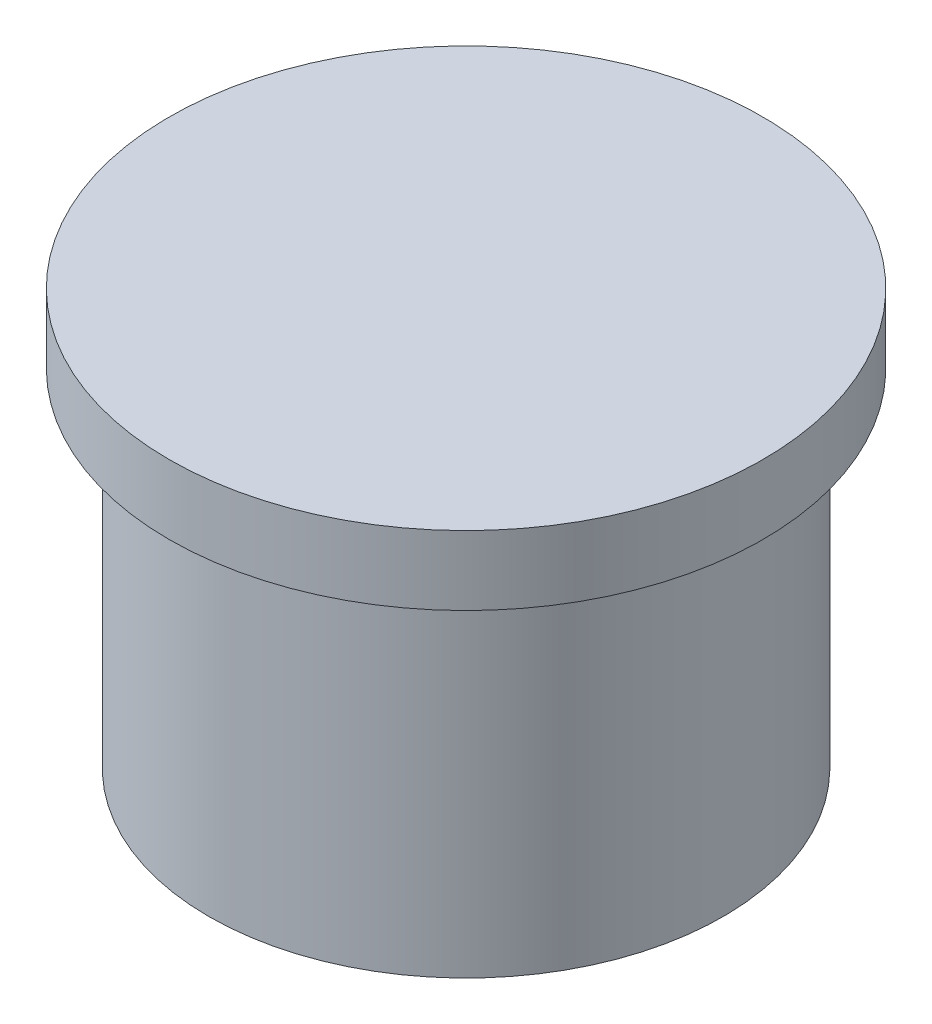
ISO-10303-21;
HEADER;
FILE_DESCRIPTION(('STEP AP214'),'2;1');
FILE_NAME('part.step','',(''),(''),'','','');
FILE_SCHEMA(('AUTOMOTIVE_DESIGN { 1 0 10303 214 1 1 1 1 }'));
ENDSEC;
DATA;
#1=APPLICATION_CONTEXT('core data for automotive mechanical design processes');
#2=APPLICATION_PROTOCOL_DEFINITION('international standard','automotive_design',2000,#1);
#3=PRODUCT_CONTEXT('',#1,'mechanical');
#4=PRODUCT('Part','Part','',(#3));
#5=PRODUCT_RELATED_PRODUCT_CATEGORY('part','',(#4));
#6=PRODUCT_DEFINITION_FORMATION('','',#4);
#7=PRODUCT_DEFINITION_CONTEXT('part definition',#1,'design');
#8=PRODUCT_DEFINITION('design','',#6,#7);
#9=PRODUCT_DEFINITION_SHAPE('','',#8);
#10=(LENGTH_UNIT() NAMED_UNIT(*) SI_UNIT(.MILLI.,.METRE.));
#11=(NAMED_UNIT(*) PLANE_ANGLE_UNIT() SI_UNIT($,.RADIAN.));
#12=(NAMED_UNIT(*) SI_UNIT($,.STERADIAN.) SOLID_ANGLE_UNIT());
#13=UNCERTAINTY_MEASURE_WITH_UNIT(LENGTH_MEASURE(1.E-05),#10,'distance_accuracy_value','');
#14=(GEOMETRIC_REPRESENTATION_CONTEXT(3) GLOBAL_UNCERTAINTY_ASSIGNED_CONTEXT((#13)) GLOBAL_UNIT_ASSIGNED_CONTEXT((#10,
#11,#12)) REPRESENTATION_CONTEXT('',''));
#15=CARTESIAN_POINT('',(0.,0.,0.));
#16=DIRECTION('',(0.,0.,1.));
#17=DIRECTION('',(1.,0.,0.));
#18=AXIS2_PLACEMENT_3D('',#15,#16,#17);
#19=CARTESIAN_POINT('',(0.,35.,0.));
#20=DIRECTION('',(0.,-1.,0.));
#21=DIRECTION('',(0.,0.,-1.));
#22=AXIS2_PLACEMENT_3D('',#19,#20,#21);
#23=CYLINDRICAL_SURFACE('',#22,26.);
#24=CARTESIAN_POINT('',(0.,35.,0.));
#25=DIRECTION('',(0.,1.,0.));
#26=DIRECTION('',(0.,0.,1.));
#27=AXIS2_PLACEMENT_3D('',#24,#25,#26);
#28=CIRCLE('',#27,26.);
#29=CARTESIAN_POINT('',(0.,35.,26.));
#30=VERTEX_POINT('',#29);
#31=EDGE_CURVE('E10',#30,#30,#28,.T.);
#32=ORIENTED_EDGE('',*,*,#31,.F.);
#33=EDGE_LOOP('',(#32));
#34=FACE_BOUND('',#33,.T.);
#35=CARTESIAN_POINT('',(0.,0.,0.));
#36=DIRECTION('',(0.,1.,0.));
#37=DIRECTION('',(0.,0.,1.));
#38=AXIS2_PLACEMENT_3D('',#35,#36,#37);
#39=CIRCLE('',#38,26.);
#40=CARTESIAN_POINT('',(0.,0.,26.));
#41=VERTEX_POINT('',#40);
#42=EDGE_CURVE('E36',#41,#41,#39,.T.);
#43=ORIENTED_EDGE('',*,*,#42,.T.);
#44=EDGE_LOOP('',(#43));
#45=FACE_BOUND('',#44,.T.);
#46=ADVANCED_FACE('F33',(#34,#45),#23,.T.);
#47=CARTESIAN_POINT('',(0.,0.,0.));
#48=DIRECTION('',(0.,1.,0.));
#49=DIRECTION('',(0.,0.,1.));
#50=AXIS2_PLACEMENT_3D('',#47,#48,#49);
#51=PLANE('',#50);
#52=ORIENTED_EDGE('',*,*,#42,.F.);
#53=EDGE_LOOP('',(#52));
#54=FACE_BOUND('',#53,.T.);
#55=ADVANCED_FACE('F56',(#54),#51,.F.);
#56=CARTESIAN_POINT('',(0.,42.,0.));
#57=DIRECTION('',(0.,-1.,0.));
#58=DIRECTION('',(0.,0.,-1.));
#59=AXIS2_PLACEMENT_3D('',#56,#57,#58);
#60=CYLINDRICAL_SURFACE('',#59,30.);
#61=CARTESIAN_POINT('',(0.,42.,0.));
#62=DIRECTION('',(0.,1.,0.));
#63=DIRECTION('',(0.,0.,1.));
#64=AXIS2_PLACEMENT_3D('',#61,#62,#63);
#65=CIRCLE('',#64,30.);
#66=CARTESIAN_POINT('',(0.,42.,30.));
#67=VERTEX_POINT('',#66);
#68=EDGE_CURVE('E43',#67,#67,#65,.T.);
#69=ORIENTED_EDGE('',*,*,#68,.F.);
#70=EDGE_LOOP('',(#69));
#71=FACE_BOUND('',#70,.T.);
#72=CARTESIAN_POINT('',(0.,35.,0.));
#73=DIRECTION('',(0.,1.,0.));
#74=DIRECTION('',(0.,0.,1.));
#75=AXIS2_PLACEMENT_3D('',#72,#73,#74);
#76=CIRCLE('',#75,30.);
#77=CARTESIAN_POINT('',(0.,35.,30.));
#78=VERTEX_POINT('',#77);
#79=EDGE_CURVE('E45',#78,#78,#76,.T.);
#80=ORIENTED_EDGE('',*,*,#79,.T.);
#81=EDGE_LOOP('',(#80));
#82=FACE_BOUND('',#81,.T.);
#83=ADVANCED_FACE('F53',(#71,#82),#60,.T.);
#84=CARTESIAN_POINT('',(0.,42.,0.));
#85=DIRECTION('',(0.,1.,0.));
#86=DIRECTION('',(0.,0.,1.));
#87=AXIS2_PLACEMENT_3D('',#84,#85,#86);
#88=PLANE('',#87);
#89=ORIENTED_EDGE('',*,*,#68,.T.);
#90=EDGE_LOOP('',(#89));
#91=FACE_BOUND('',#90,.T.);
#92=ADVANCED_FACE('F51',(#91),#88,.T.);
#93=CARTESIAN_POINT('',(0.,35.,0.));
#94=DIRECTION('',(0.,1.,0.));
#95=DIRECTION('',(0.,0.,1.));
#96=AXIS2_PLACEMENT_3D('',#93,#94,#95);
#97=PLANE('',#96);
#98=ORIENTED_EDGE('',*,*,#31,.T.);
#99=EDGE_LOOP('',(#98));
#100=FACE_BOUND('',#99,.T.);
#101=ORIENTED_EDGE('',*,*,#79,.F.);
#102=EDGE_LOOP('',(#101));
#103=FACE_BOUND('',#102,.T.);
#104=ADVANCED_FACE('F60',(#100,#103),#97,.F.);
#105=CLOSED_SHELL('',(#46,#55,#83,#92,#104));
#106=MANIFOLD_SOLID_BREP('B2',#105);
#107=ADVANCED_BREP_SHAPE_REPRESENTATION('',(#18,#106),#14);
#108=SHAPE_DEFINITION_REPRESENTATION(#9,#107);
ENDSEC;
END-ISO-10303-21;
